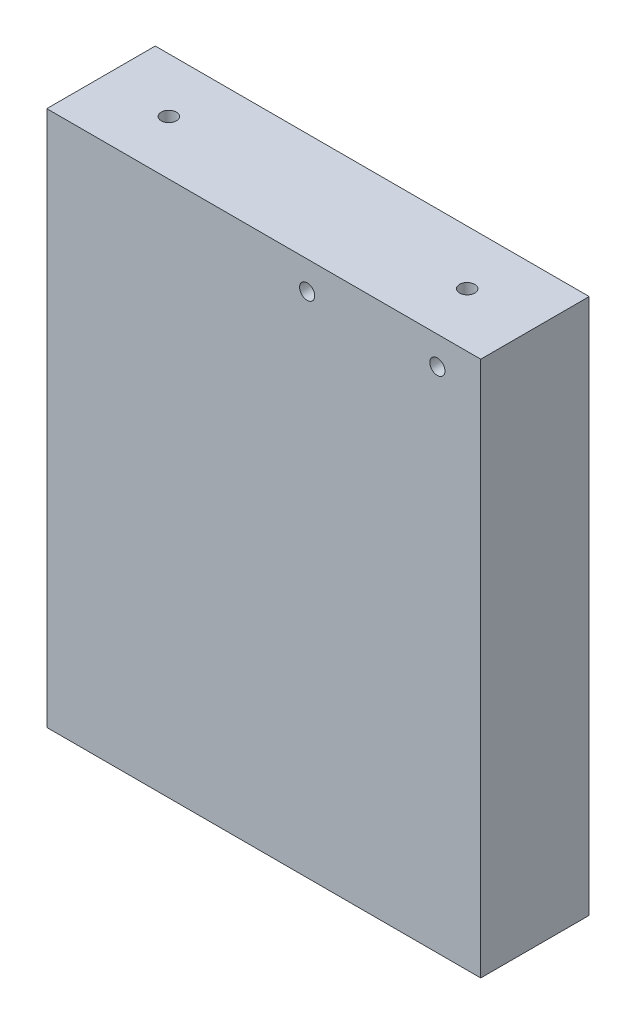
ISO-10303-21;
HEADER;
FILE_DESCRIPTION(('STEP AP214'),'2;1');
FILE_NAME('part.step','',(''),(''),'','','');
FILE_SCHEMA(('AUTOMOTIVE_DESIGN { 1 0 10303 214 1 1 1 1 }'));
ENDSEC;
DATA;
#1=APPLICATION_CONTEXT('core data for automotive mechanical design processes');
#2=APPLICATION_PROTOCOL_DEFINITION('international standard','automotive_design',2000,#1);
#3=PRODUCT_CONTEXT('',#1,'mechanical');
#4=PRODUCT('Part','Part','',(#3));
#5=PRODUCT_RELATED_PRODUCT_CATEGORY('part','',(#4));
#6=PRODUCT_DEFINITION_FORMATION('','',#4);
#7=PRODUCT_DEFINITION_CONTEXT('part definition',#1,'design');
#8=PRODUCT_DEFINITION('design','',#6,#7);
#9=PRODUCT_DEFINITION_SHAPE('','',#8);
#10=(LENGTH_UNIT() NAMED_UNIT(*) SI_UNIT(.MILLI.,.METRE.));
#11=(NAMED_UNIT(*) PLANE_ANGLE_UNIT() SI_UNIT($,.RADIAN.));
#12=(NAMED_UNIT(*) SI_UNIT($,.STERADIAN.) SOLID_ANGLE_UNIT());
#13=UNCERTAINTY_MEASURE_WITH_UNIT(LENGTH_MEASURE(1.E-05),#10,'distance_accuracy_value','');
#14=(GEOMETRIC_REPRESENTATION_CONTEXT(3) GLOBAL_UNCERTAINTY_ASSIGNED_CONTEXT((#13)) GLOBAL_UNIT_ASSIGNED_CONTEXT((#10,
#11,#12)) REPRESENTATION_CONTEXT('',''));
#15=CARTESIAN_POINT('',(0.,0.,0.));
#16=DIRECTION('',(0.,0.,1.));
#17=DIRECTION('',(1.,0.,0.));
#18=AXIS2_PLACEMENT_3D('',#15,#16,#17);
#19=CARTESIAN_POINT('',(0.,62.738,0.));
#20=DIRECTION('',(1.,0.,0.));
#21=DIRECTION('',(0.,0.,-1.));
#22=AXIS2_PLACEMENT_3D('',#19,#20,#21);
#23=PLANE('',#22);
#24=DIRECTION('',(0.,0.,1.));
#25=VECTOR('',#24,1.);
#26=CARTESIAN_POINT('',(0.,0.,0.));
#27=LINE('',#26,#25);
#28=CARTESIAN_POINT('',(0.,0.,0.));
#29=VERTEX_POINT('',#28);
#30=CARTESIAN_POINT('',(0.,0.,12.7));
#31=VERTEX_POINT('',#30);
#32=EDGE_CURVE('E147',#29,#31,#27,.T.);
#33=ORIENTED_EDGE('',*,*,#32,.T.);
#34=DIRECTION('',(0.,-1.,0.));
#35=VECTOR('',#34,1.);
#36=CARTESIAN_POINT('',(0.,62.738,12.7));
#37=LINE('',#36,#35);
#38=CARTESIAN_POINT('',(0.,62.738,12.7));
#39=VERTEX_POINT('',#38);
#40=EDGE_CURVE('E11',#39,#31,#37,.T.);
#41=ORIENTED_EDGE('',*,*,#40,.F.);
#42=DIRECTION('',(0.,0.,1.));
#43=VECTOR('',#42,1.);
#44=CARTESIAN_POINT('',(0.,62.738,0.));
#45=LINE('',#44,#43);
#46=CARTESIAN_POINT('',(0.,62.738,0.));
#47=VERTEX_POINT('',#46);
#48=EDGE_CURVE('E148',#47,#39,#45,.T.);
#49=ORIENTED_EDGE('',*,*,#48,.F.);
#50=DIRECTION('',(0.,-1.,0.));
#51=VECTOR('',#50,1.);
#52=CARTESIAN_POINT('',(0.,62.738,0.));
#53=LINE('',#52,#51);
#54=EDGE_CURVE('E154',#47,#29,#53,.T.);
#55=ORIENTED_EDGE('',*,*,#54,.T.);
#56=EDGE_LOOP('',(#33,#41,#49,#55));
#57=FACE_BOUND('',#56,.T.);
#58=ADVANCED_FACE('F36',(#57),#23,.F.);
#59=CARTESIAN_POINT('',(0.,62.738,12.7));
#60=DIRECTION('',(0.,0.,-1.));
#61=DIRECTION('',(-1.,0.,0.));
#62=AXIS2_PLACEMENT_3D('',#59,#60,#61);
#63=PLANE('',#62);
#64=CARTESIAN_POINT('',(30.48,59.436,12.7));
#65=DIRECTION('',(0.,0.,1.));
#66=DIRECTION('',(1.,0.,0.));
#67=AXIS2_PLACEMENT_3D('',#64,#65,#66);
#68=CIRCLE('',#67,0.888999999999987);
#69=CARTESIAN_POINT('',(31.369,59.436,12.7));
#70=VERTEX_POINT('',#69);
#71=EDGE_CURVE('E113',#70,#70,#68,.T.);
#72=ORIENTED_EDGE('',*,*,#71,.F.);
#73=EDGE_LOOP('',(#72));
#74=FACE_BOUND('',#73,.T.);
#75=CARTESIAN_POINT('',(45.72,59.436,12.7));
#76=DIRECTION('',(0.,0.,1.));
#77=DIRECTION('',(1.,0.,0.));
#78=AXIS2_PLACEMENT_3D('',#75,#76,#77);
#79=CIRCLE('',#78,0.888999999999987);
#80=CARTESIAN_POINT('',(46.609,59.436,12.7));
#81=VERTEX_POINT('',#80);
#82=EDGE_CURVE('E112',#81,#81,#79,.T.);
#83=ORIENTED_EDGE('',*,*,#82,.F.);
#84=EDGE_LOOP('',(#83));
#85=FACE_BOUND('',#84,.T.);
#86=DIRECTION('',(1.,0.,0.));
#87=VECTOR('',#86,1.);
#88=CARTESIAN_POINT('',(0.,0.,12.7));
#89=LINE('',#88,#87);
#90=CARTESIAN_POINT('',(50.8,0.,12.7));
#91=VERTEX_POINT('',#90);
#92=EDGE_CURVE('E157',#31,#91,#89,.T.);
#93=ORIENTED_EDGE('',*,*,#92,.T.);
#94=DIRECTION('',(0.,-1.,0.));
#95=VECTOR('',#94,1.);
#96=CARTESIAN_POINT('',(50.8,62.738,12.7));
#97=LINE('',#96,#95);
#98=CARTESIAN_POINT('',(50.8,62.738,12.7));
#99=VERTEX_POINT('',#98);
#100=EDGE_CURVE('E44',#99,#91,#97,.T.);
#101=ORIENTED_EDGE('',*,*,#100,.F.);
#102=DIRECTION('',(1.,0.,0.));
#103=VECTOR('',#102,1.);
#104=CARTESIAN_POINT('',(0.,62.738,12.7));
#105=LINE('',#104,#103);
#106=EDGE_CURVE('E83',#39,#99,#105,.T.);
#107=ORIENTED_EDGE('',*,*,#106,.F.);
#108=ORIENTED_EDGE('',*,*,#40,.T.);
#109=EDGE_LOOP('',(#93,#101,#107,#108));
#110=FACE_BOUND('',#109,.T.);
#111=ADVANCED_FACE('F181',(#74,#85,#110),#63,.F.);
#112=CARTESIAN_POINT('',(50.8,62.738,0.));
#113=DIRECTION('',(-1.,0.,0.));
#114=DIRECTION('',(0.,0.,1.));
#115=AXIS2_PLACEMENT_3D('',#112,#113,#114);
#116=PLANE('',#115);
#117=DIRECTION('',(0.,0.,-1.));
#118=VECTOR('',#117,1.);
#119=CARTESIAN_POINT('',(50.8,0.,0.));
#120=LINE('',#119,#118);
#121=CARTESIAN_POINT('',(50.8,0.,0.));
#122=VERTEX_POINT('',#121);
#123=EDGE_CURVE('E70',#91,#122,#120,.T.);
#124=ORIENTED_EDGE('',*,*,#123,.T.);
#125=DIRECTION('',(0.,-1.,0.));
#126=VECTOR('',#125,1.);
#127=CARTESIAN_POINT('',(50.8,62.738,0.));
#128=LINE('',#127,#126);
#129=CARTESIAN_POINT('',(50.8,62.738,0.));
#130=VERTEX_POINT('',#129);
#131=EDGE_CURVE('E162',#130,#122,#128,.T.);
#132=ORIENTED_EDGE('',*,*,#131,.F.);
#133=DIRECTION('',(0.,0.,-1.));
#134=VECTOR('',#133,1.);
#135=CARTESIAN_POINT('',(50.8,62.738,0.));
#136=LINE('',#135,#134);
#137=EDGE_CURVE('E151',#99,#130,#136,.T.);
#138=ORIENTED_EDGE('',*,*,#137,.F.);
#139=ORIENTED_EDGE('',*,*,#100,.T.);
#140=EDGE_LOOP('',(#124,#132,#138,#139));
#141=FACE_BOUND('',#140,.T.);
#142=ADVANCED_FACE('F164',(#141),#116,.F.);
#143=CARTESIAN_POINT('',(0.,62.738,0.));
#144=DIRECTION('',(0.,0.,1.));
#145=DIRECTION('',(1.,0.,0.));
#146=AXIS2_PLACEMENT_3D('',#143,#144,#145);
#147=PLANE('',#146);
#148=DIRECTION('',(-1.,0.,0.));
#149=VECTOR('',#148,1.);
#150=CARTESIAN_POINT('',(0.,0.,0.));
#151=LINE('',#150,#149);
#152=EDGE_CURVE('E76',#122,#29,#151,.T.);
#153=ORIENTED_EDGE('',*,*,#152,.T.);
#154=ORIENTED_EDGE('',*,*,#54,.F.);
#155=DIRECTION('',(-1.,0.,0.));
#156=VECTOR('',#155,1.);
#157=CARTESIAN_POINT('',(0.,62.738,0.));
#158=LINE('',#157,#156);
#159=EDGE_CURVE('E52',#130,#47,#158,.T.);
#160=ORIENTED_EDGE('',*,*,#159,.F.);
#161=ORIENTED_EDGE('',*,*,#131,.T.);
#162=EDGE_LOOP('',(#153,#154,#160,#161));
#163=FACE_BOUND('',#162,.T.);
#164=ADVANCED_FACE('F171',(#163),#147,.F.);
#165=CARTESIAN_POINT('',(0.,62.738,0.));
#166=DIRECTION('',(0.,1.,0.));
#167=DIRECTION('',(0.,0.,1.));
#168=AXIS2_PLACEMENT_3D('',#165,#166,#167);
#169=PLANE('',#168);
#170=CARTESIAN_POINT('',(7.9375,62.738,6.35));
#171=DIRECTION('',(0.,1.,0.));
#172=DIRECTION('',(0.,0.,1.));
#173=AXIS2_PLACEMENT_3D('',#170,#171,#172);
#174=CIRCLE('',#173,0.888999999999999);
#175=CARTESIAN_POINT('',(7.9375,62.738,7.239));
#176=VERTEX_POINT('',#175);
#177=EDGE_CURVE('E123',#176,#176,#174,.T.);
#178=ORIENTED_EDGE('',*,*,#177,.F.);
#179=EDGE_LOOP('',(#178));
#180=FACE_BOUND('',#179,.T.);
#181=CARTESIAN_POINT('',(42.8625,62.738,6.35));
#182=DIRECTION('',(0.,1.,0.));
#183=DIRECTION('',(0.,0.,1.));
#184=AXIS2_PLACEMENT_3D('',#181,#182,#183);
#185=CIRCLE('',#184,0.889000000000001);
#186=CARTESIAN_POINT('',(42.8625,62.738,7.239));
#187=VERTEX_POINT('',#186);
#188=EDGE_CURVE('E129',#187,#187,#185,.T.);
#189=ORIENTED_EDGE('',*,*,#188,.F.);
#190=EDGE_LOOP('',(#189));
#191=FACE_BOUND('',#190,.T.);
#192=ORIENTED_EDGE('',*,*,#48,.T.);
#193=ORIENTED_EDGE('',*,*,#106,.T.);
#194=ORIENTED_EDGE('',*,*,#137,.T.);
#195=ORIENTED_EDGE('',*,*,#159,.T.);
#196=EDGE_LOOP('',(#192,#193,#194,#195));
#197=FACE_BOUND('',#196,.T.);
#198=ADVANCED_FACE('F173',(#180,#191,#197),#169,.T.);
#199=CARTESIAN_POINT('',(0.,0.,0.));
#200=DIRECTION('',(0.,1.,0.));
#201=DIRECTION('',(0.,0.,1.));
#202=AXIS2_PLACEMENT_3D('',#199,#200,#201);
#203=PLANE('',#202);
#204=CARTESIAN_POINT('',(6.34999999999999,0.,6.35));
#205=DIRECTION('',(0.,-1.,0.));
#206=DIRECTION('',(0.,0.,-1.));
#207=AXIS2_PLACEMENT_3D('',#204,#205,#206);
#208=CIRCLE('',#207,1.7272);
#209=CARTESIAN_POINT('',(6.34999999999999,0.,4.6228));
#210=VERTEX_POINT('',#209);
#211=EDGE_CURVE('E135',#210,#210,#208,.T.);
#212=ORIENTED_EDGE('',*,*,#211,.F.);
#213=EDGE_LOOP('',(#212));
#214=FACE_BOUND('',#213,.T.);
#215=CARTESIAN_POINT('',(44.45,0.,6.35));
#216=DIRECTION('',(0.,-1.,0.));
#217=DIRECTION('',(0.,0.,-1.));
#218=AXIS2_PLACEMENT_3D('',#215,#216,#217);
#219=CIRCLE('',#218,1.7272);
#220=CARTESIAN_POINT('',(44.45,0.,4.6228));
#221=VERTEX_POINT('',#220);
#222=EDGE_CURVE('E141',#221,#221,#219,.T.);
#223=ORIENTED_EDGE('',*,*,#222,.F.);
#224=EDGE_LOOP('',(#223));
#225=FACE_BOUND('',#224,.T.);
#226=ORIENTED_EDGE('',*,*,#32,.F.);
#227=ORIENTED_EDGE('',*,*,#152,.F.);
#228=ORIENTED_EDGE('',*,*,#123,.F.);
#229=ORIENTED_EDGE('',*,*,#92,.F.);
#230=EDGE_LOOP('',(#226,#227,#228,#229));
#231=FACE_BOUND('',#230,.T.);
#232=ADVANCED_FACE('F167',(#214,#225,#231),#203,.F.);
#233=CARTESIAN_POINT('',(44.45,17.6276,6.35));
#234=DIRECTION('',(0.,-1.,0.));
#235=DIRECTION('',(0.,0.,-1.));
#236=AXIS2_PLACEMENT_3D('',#233,#234,#235);
#237=CONICAL_SURFACE('',#236,1.7272,1.02974425867665);
#238=CARTESIAN_POINT('',(44.45,18.6654064611844,6.35));
#239=VERTEX_POINT('',#238);
#240=VERTEX_LOOP('',#239);
#241=FACE_BOUND('',#240,.T.);
#242=CARTESIAN_POINT('',(44.45,17.6276,6.35));
#243=DIRECTION('',(0.,-1.,0.));
#244=DIRECTION('',(0.,0.,-1.));
#245=AXIS2_PLACEMENT_3D('',#242,#243,#244);
#246=CIRCLE('',#245,1.7272);
#247=CARTESIAN_POINT('',(44.45,17.6276,4.6228));
#248=VERTEX_POINT('',#247);
#249=EDGE_CURVE('E144',#248,#248,#246,.T.);
#250=ORIENTED_EDGE('',*,*,#249,.T.);
#251=EDGE_LOOP('',(#250));
#252=FACE_BOUND('',#251,.T.);
#253=ADVANCED_FACE('F234',(#241,#252),#237,.F.);
#254=CARTESIAN_POINT('',(44.45,0.,6.35));
#255=DIRECTION('',(0.,-1.,0.));
#256=DIRECTION('',(0.,0.,-1.));
#257=AXIS2_PLACEMENT_3D('',#254,#255,#256);
#258=CYLINDRICAL_SURFACE('',#257,1.7272);
#259=ORIENTED_EDGE('',*,*,#249,.F.);
#260=EDGE_LOOP('',(#259));
#261=FACE_BOUND('',#260,.T.);
#262=ORIENTED_EDGE('',*,*,#222,.T.);
#263=EDGE_LOOP('',(#262));
#264=FACE_BOUND('',#263,.T.);
#265=ADVANCED_FACE('F230',(#261,#264),#258,.F.);
#266=CARTESIAN_POINT('',(6.34999999999999,17.6276,6.35));
#267=DIRECTION('',(0.,-1.,0.));
#268=DIRECTION('',(0.,0.,-1.));
#269=AXIS2_PLACEMENT_3D('',#266,#267,#268);
#270=CONICAL_SURFACE('',#269,1.7272,1.02974425867665);
#271=CARTESIAN_POINT('',(6.34999999999999,18.6654064611844,6.35));
#272=VERTEX_POINT('',#271);
#273=VERTEX_LOOP('',#272);
#274=FACE_BOUND('',#273,.T.);
#275=CARTESIAN_POINT('',(6.34999999999999,17.6276,6.35));
#276=DIRECTION('',(0.,-1.,0.));
#277=DIRECTION('',(0.,0.,-1.));
#278=AXIS2_PLACEMENT_3D('',#275,#276,#277);
#279=CIRCLE('',#278,1.7272);
#280=CARTESIAN_POINT('',(6.34999999999999,17.6276,4.6228));
#281=VERTEX_POINT('',#280);
#282=EDGE_CURVE('E138',#281,#281,#279,.T.);
#283=ORIENTED_EDGE('',*,*,#282,.T.);
#284=EDGE_LOOP('',(#283));
#285=FACE_BOUND('',#284,.T.);
#286=ADVANCED_FACE('F226',(#274,#285),#270,.F.);
#287=CARTESIAN_POINT('',(6.34999999999999,0.,6.35));
#288=DIRECTION('',(0.,-1.,0.));
#289=DIRECTION('',(0.,0.,-1.));
#290=AXIS2_PLACEMENT_3D('',#287,#288,#289);
#291=CYLINDRICAL_SURFACE('',#290,1.7272);
#292=ORIENTED_EDGE('',*,*,#282,.F.);
#293=EDGE_LOOP('',(#292));
#294=FACE_BOUND('',#293,.T.);
#295=ORIENTED_EDGE('',*,*,#211,.T.);
#296=EDGE_LOOP('',(#295));
#297=FACE_BOUND('',#296,.T.);
#298=ADVANCED_FACE('F222',(#294,#297),#291,.F.);
#299=CARTESIAN_POINT('',(42.8625,50.038,6.35));
#300=DIRECTION('',(0.,1.,0.));
#301=DIRECTION('',(0.,0.,1.));
#302=AXIS2_PLACEMENT_3D('',#299,#300,#301);
#303=CONICAL_SURFACE('',#302,0.889000000000001,1.02974425867665);
#304=CARTESIAN_POINT('',(42.8625,49.5038349096845,6.35));
#305=VERTEX_POINT('',#304);
#306=VERTEX_LOOP('',#305);
#307=FACE_BOUND('',#306,.T.);
#308=CARTESIAN_POINT('',(42.8625,50.038,6.35));
#309=DIRECTION('',(0.,1.,0.));
#310=DIRECTION('',(0.,0.,1.));
#311=AXIS2_PLACEMENT_3D('',#308,#309,#310);
#312=CIRCLE('',#311,0.889000000000001);
#313=CARTESIAN_POINT('',(42.8625,50.038,7.239));
#314=VERTEX_POINT('',#313);
#315=EDGE_CURVE('E132',#314,#314,#312,.T.);
#316=ORIENTED_EDGE('',*,*,#315,.T.);
#317=EDGE_LOOP('',(#316));
#318=FACE_BOUND('',#317,.T.);
#319=ADVANCED_FACE('F218',(#307,#318),#303,.F.);
#320=CARTESIAN_POINT('',(42.8625,62.738,6.35));
#321=DIRECTION('',(0.,1.,0.));
#322=DIRECTION('',(0.,0.,1.));
#323=AXIS2_PLACEMENT_3D('',#320,#321,#322);
#324=CYLINDRICAL_SURFACE('',#323,0.889000000000001);
#325=ORIENTED_EDGE('',*,*,#315,.F.);
#326=EDGE_LOOP('',(#325));
#327=FACE_BOUND('',#326,.T.);
#328=ORIENTED_EDGE('',*,*,#188,.T.);
#329=EDGE_LOOP('',(#328));
#330=FACE_BOUND('',#329,.T.);
#331=ADVANCED_FACE('F214',(#327,#330),#324,.F.);
#332=CARTESIAN_POINT('',(7.9375,50.038,6.35));
#333=DIRECTION('',(0.,1.,0.));
#334=DIRECTION('',(0.,0.,1.));
#335=AXIS2_PLACEMENT_3D('',#332,#333,#334);
#336=CONICAL_SURFACE('',#335,0.888999999999997,1.02974425867665);
#337=CARTESIAN_POINT('',(7.9375,49.5038349096845,6.35));
#338=VERTEX_POINT('',#337);
#339=VERTEX_LOOP('',#338);
#340=FACE_BOUND('',#339,.T.);
#341=CARTESIAN_POINT('',(7.9375,50.038,6.35));
#342=DIRECTION('',(0.,1.,0.));
#343=DIRECTION('',(0.,0.,1.));
#344=AXIS2_PLACEMENT_3D('',#341,#342,#343);
#345=CIRCLE('',#344,0.888999999999997);
#346=CARTESIAN_POINT('',(7.9375,50.038,7.239));
#347=VERTEX_POINT('',#346);
#348=EDGE_CURVE('E126',#347,#347,#345,.T.);
#349=ORIENTED_EDGE('',*,*,#348,.T.);
#350=EDGE_LOOP('',(#349));
#351=FACE_BOUND('',#350,.T.);
#352=ADVANCED_FACE('F210',(#340,#351),#336,.F.);
#353=CARTESIAN_POINT('',(7.9375,62.738,6.35));
#354=DIRECTION('',(0.,1.,0.));
#355=DIRECTION('',(0.,0.,1.));
#356=AXIS2_PLACEMENT_3D('',#353,#354,#355);
#357=CYLINDRICAL_SURFACE('',#356,0.888999999999998);
#358=ORIENTED_EDGE('',*,*,#348,.F.);
#359=EDGE_LOOP('',(#358));
#360=FACE_BOUND('',#359,.T.);
#361=ORIENTED_EDGE('',*,*,#177,.T.);
#362=EDGE_LOOP('',(#361));
#363=FACE_BOUND('',#362,.T.);
#364=ADVANCED_FACE('F202',(#360,#363),#357,.F.);
#365=CARTESIAN_POINT('',(45.72,59.436,1.8796));
#366=DIRECTION('',(0.,0.,1.));
#367=DIRECTION('',(1.,0.,0.));
#368=AXIS2_PLACEMENT_3D('',#365,#366,#367);
#369=CONICAL_SURFACE('',#368,0.889000000000001,1.02974425867665);
#370=CARTESIAN_POINT('',(45.72,59.436,1.3454349096845));
#371=VERTEX_POINT('',#370);
#372=VERTEX_LOOP('',#371);
#373=FACE_BOUND('',#372,.T.);
#374=CARTESIAN_POINT('',(45.72,59.436,1.8796));
#375=DIRECTION('',(0.,0.,1.));
#376=DIRECTION('',(1.,0.,0.));
#377=AXIS2_PLACEMENT_3D('',#374,#375,#376);
#378=CIRCLE('',#377,0.889000000000001);
#379=CARTESIAN_POINT('',(46.609,59.436,1.8796));
#380=VERTEX_POINT('',#379);
#381=EDGE_CURVE('E116',#380,#380,#378,.T.);
#382=ORIENTED_EDGE('',*,*,#381,.T.);
#383=EDGE_LOOP('',(#382));
#384=FACE_BOUND('',#383,.T.);
#385=ADVANCED_FACE('F196',(#373,#384),#369,.F.);
#386=CARTESIAN_POINT('',(45.72,59.436,12.7));
#387=DIRECTION('',(0.,0.,1.));
#388=DIRECTION('',(1.,0.,0.));
#389=AXIS2_PLACEMENT_3D('',#386,#387,#388);
#390=CYLINDRICAL_SURFACE('',#389,0.888999999999994);
#391=ORIENTED_EDGE('',*,*,#381,.F.);
#392=EDGE_LOOP('',(#391));
#393=FACE_BOUND('',#392,.T.);
#394=ORIENTED_EDGE('',*,*,#82,.T.);
#395=EDGE_LOOP('',(#394));
#396=FACE_BOUND('',#395,.T.);
#397=ADVANCED_FACE('F106',(#393,#396),#390,.F.);
#398=CARTESIAN_POINT('',(30.48,59.436,1.8796));
#399=DIRECTION('',(0.,0.,1.));
#400=DIRECTION('',(1.,0.,0.));
#401=AXIS2_PLACEMENT_3D('',#398,#399,#400);
#402=CONICAL_SURFACE('',#401,0.889000000000001,1.02974425867665);
#403=CARTESIAN_POINT('',(30.48,59.436,1.3454349096845));
#404=VERTEX_POINT('',#403);
#405=VERTEX_LOOP('',#404);
#406=FACE_BOUND('',#405,.T.);
#407=CARTESIAN_POINT('',(30.48,59.436,1.8796));
#408=DIRECTION('',(0.,0.,1.));
#409=DIRECTION('',(1.,0.,0.));
#410=AXIS2_PLACEMENT_3D('',#407,#408,#409);
#411=CIRCLE('',#410,0.889000000000001);
#412=CARTESIAN_POINT('',(31.369,59.436,1.8796));
#413=VERTEX_POINT('',#412);
#414=EDGE_CURVE('E110',#413,#413,#411,.T.);
#415=ORIENTED_EDGE('',*,*,#414,.T.);
#416=EDGE_LOOP('',(#415));
#417=FACE_BOUND('',#416,.T.);
#418=ADVANCED_FACE('F102',(#406,#417),#402,.F.);
#419=CARTESIAN_POINT('',(30.48,59.436,12.7));
#420=DIRECTION('',(0.,0.,1.));
#421=DIRECTION('',(1.,0.,0.));
#422=AXIS2_PLACEMENT_3D('',#419,#420,#421);
#423=CYLINDRICAL_SURFACE('',#422,0.888999999999994);
#424=ORIENTED_EDGE('',*,*,#414,.F.);
#425=EDGE_LOOP('',(#424));
#426=FACE_BOUND('',#425,.T.);
#427=ORIENTED_EDGE('',*,*,#71,.T.);
#428=EDGE_LOOP('',(#427));
#429=FACE_BOUND('',#428,.T.);
#430=ADVANCED_FACE('F105',(#426,#429),#423,.F.);
#431=CLOSED_SHELL('',(#58,#111,#142,#164,#198,#232,#253,#265,#286,#298,#319,#331,#352,#364,#385,
#397,#418,#430));
#432=MANIFOLD_SOLID_BREP('B2',#431);
#433=ADVANCED_BREP_SHAPE_REPRESENTATION('',(#18,#432),#14);
#434=SHAPE_DEFINITION_REPRESENTATION(#9,#433);
ENDSEC;
END-ISO-10303-21;
